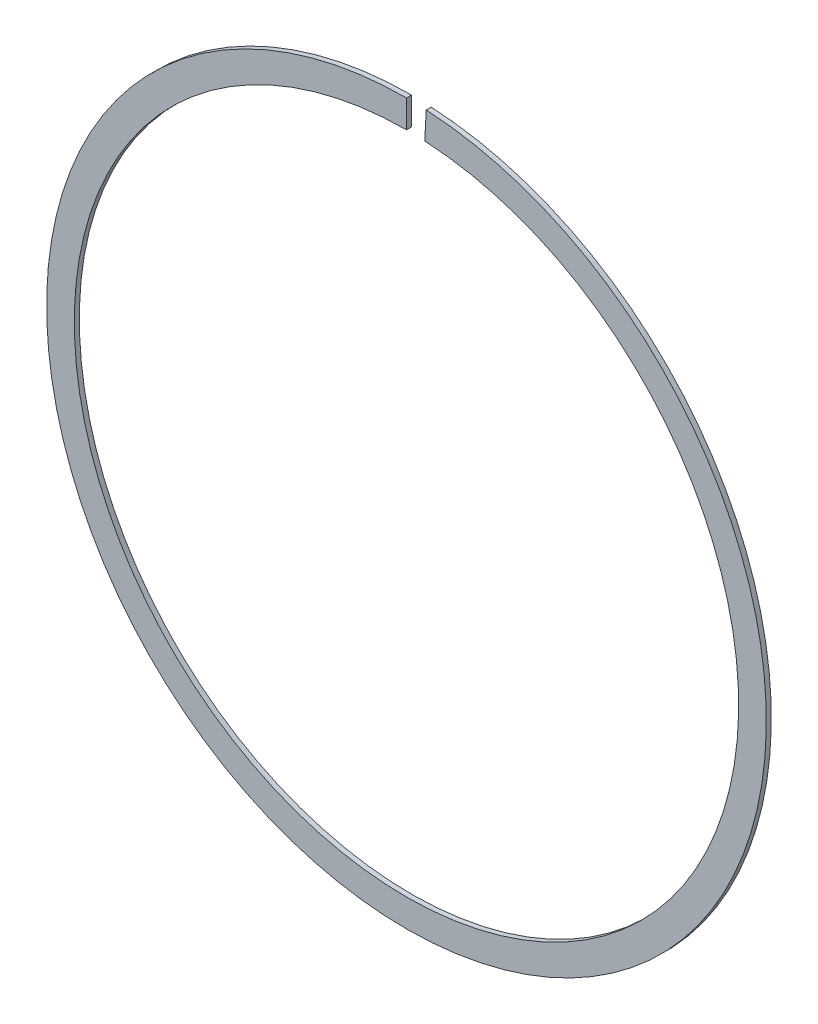
ISO-10303-21;
HEADER;
FILE_DESCRIPTION(('STEP AP214'),'2;1');
FILE_NAME('part.step','',(''),(''),'','','');
FILE_SCHEMA(('AUTOMOTIVE_DESIGN { 1 0 10303 214 1 1 1 1 }'));
ENDSEC;
DATA;
#1=APPLICATION_CONTEXT('core data for automotive mechanical design processes');
#2=APPLICATION_PROTOCOL_DEFINITION('international standard','automotive_design',2000,#1);
#3=PRODUCT_CONTEXT('',#1,'mechanical');
#4=PRODUCT('Part','Part','',(#3));
#5=PRODUCT_RELATED_PRODUCT_CATEGORY('part','',(#4));
#6=PRODUCT_DEFINITION_FORMATION('','',#4);
#7=PRODUCT_DEFINITION_CONTEXT('part definition',#1,'design');
#8=PRODUCT_DEFINITION('design','',#6,#7);
#9=PRODUCT_DEFINITION_SHAPE('','',#8);
#10=(LENGTH_UNIT() NAMED_UNIT(*) SI_UNIT(.MILLI.,.METRE.));
#11=(NAMED_UNIT(*) PLANE_ANGLE_UNIT() SI_UNIT($,.RADIAN.));
#12=(NAMED_UNIT(*) SI_UNIT($,.STERADIAN.) SOLID_ANGLE_UNIT());
#13=UNCERTAINTY_MEASURE_WITH_UNIT(LENGTH_MEASURE(1.E-05),#10,'distance_accuracy_value','');
#14=(GEOMETRIC_REPRESENTATION_CONTEXT(3) GLOBAL_UNCERTAINTY_ASSIGNED_CONTEXT((#13)) GLOBAL_UNIT_ASSIGNED_CONTEXT((#10,
#11,#12)) REPRESENTATION_CONTEXT('',''));
#15=CARTESIAN_POINT('',(0.,0.,0.));
#16=DIRECTION('',(0.,0.,1.));
#17=DIRECTION('',(1.,0.,0.));
#18=AXIS2_PLACEMENT_3D('',#15,#16,#17);
#19=CARTESIAN_POINT('',(0.,0.,0.));
#20=DIRECTION('',(1.,0.,0.));
#21=DIRECTION('',(0.,0.,-1.));
#22=AXIS2_PLACEMENT_3D('',#19,#20,#21);
#23=PLANE('',#22);
#24=DIRECTION('',(0.,-1.,0.));
#25=VECTOR('',#24,1.);
#26=CARTESIAN_POINT('',(0.,32.5,0.225));
#27=LINE('',#26,#25);
#28=CARTESIAN_POINT('',(0.,32.5,0.225));
#29=VERTEX_POINT('',#28);
#30=CARTESIAN_POINT('',(0.,30.,0.225));
#31=VERTEX_POINT('',#30);
#32=EDGE_CURVE('E89',#29,#31,#27,.T.);
#33=ORIENTED_EDGE('',*,*,#32,.T.);
#34=DIRECTION('',(0.,0.,-1.));
#35=VECTOR('',#34,1.);
#36=CARTESIAN_POINT('',(0.,30.,0.225));
#37=LINE('',#36,#35);
#38=CARTESIAN_POINT('',(0.,30.,-0.225));
#39=VERTEX_POINT('',#38);
#40=EDGE_CURVE('E82',#31,#39,#37,.T.);
#41=ORIENTED_EDGE('',*,*,#40,.T.);
#42=DIRECTION('',(0.,1.,0.));
#43=VECTOR('',#42,1.);
#44=CARTESIAN_POINT('',(0.,32.5,-0.225));
#45=LINE('',#44,#43);
#46=CARTESIAN_POINT('',(0.,32.5,-0.225));
#47=VERTEX_POINT('',#46);
#48=EDGE_CURVE('E77',#39,#47,#45,.T.);
#49=ORIENTED_EDGE('',*,*,#48,.T.);
#50=DIRECTION('',(0.,0.,1.));
#51=VECTOR('',#50,1.);
#52=CARTESIAN_POINT('',(0.,32.5,0.225));
#53=LINE('',#52,#51);
#54=EDGE_CURVE('E72',#47,#29,#53,.T.);
#55=ORIENTED_EDGE('',*,*,#54,.T.);
#56=EDGE_LOOP('',(#33,#41,#49,#55));
#57=FACE_BOUND('',#56,.T.);
#58=ADVANCED_FACE('F37',(#57),#23,.T.);
#59=CARTESIAN_POINT('',(0.,0.,0.));
#60=DIRECTION('',(0.998489097450538,-0.0549501799124381,0.));
#61=DIRECTION('',(0.,0.,-1.));
#62=AXIS2_PLACEMENT_3D('',#59,#60,#61);
#63=PLANE('',#62);
#64=DIRECTION('',(-0.0549501799124381,-0.998489097450538,0.));
#65=VECTOR('',#64,1.);
#66=CARTESIAN_POINT('',(1.78588084715424,32.4508956671425,0.225));
#67=LINE('',#66,#65);
#68=CARTESIAN_POINT('',(1.78588084715424,32.4508956671425,0.225));
#69=VERTEX_POINT('',#68);
#70=CARTESIAN_POINT('',(1.64850539737314,29.9546729235162,0.225));
#71=VERTEX_POINT('',#70);
#72=EDGE_CURVE('E98',#69,#71,#67,.T.);
#73=ORIENTED_EDGE('',*,*,#72,.F.);
#74=DIRECTION('',(0.,0.,1.));
#75=VECTOR('',#74,1.);
#76=CARTESIAN_POINT('',(1.78588084715424,32.4508956671425,0.225));
#77=LINE('',#76,#75);
#78=CARTESIAN_POINT('',(1.78588084715424,32.4508956671425,-0.225));
#79=VERTEX_POINT('',#78);
#80=EDGE_CURVE('E11',#79,#69,#77,.T.);
#81=ORIENTED_EDGE('',*,*,#80,.F.);
#82=DIRECTION('',(0.0549501799124381,0.998489097450538,0.));
#83=VECTOR('',#82,1.);
#84=CARTESIAN_POINT('',(1.78588084715424,32.4508956671425,-0.225));
#85=LINE('',#84,#83);
#86=CARTESIAN_POINT('',(1.64850539737314,29.9546729235162,-0.225));
#87=VERTEX_POINT('',#86);
#88=EDGE_CURVE('E51',#87,#79,#85,.T.);
#89=ORIENTED_EDGE('',*,*,#88,.F.);
#90=DIRECTION('',(0.,0.,-1.));
#91=VECTOR('',#90,1.);
#92=CARTESIAN_POINT('',(1.64850539737314,29.9546729235161,0.225));
#93=LINE('',#92,#91);
#94=EDGE_CURVE('E60',#71,#87,#93,.T.);
#95=ORIENTED_EDGE('',*,*,#94,.F.);
#96=EDGE_LOOP('',(#73,#81,#89,#95));
#97=FACE_BOUND('',#96,.T.);
#98=ADVANCED_FACE('F123',(#97),#63,.F.);
#99=CARTESIAN_POINT('',(0.,32.5,0.225));
#100=DIRECTION('',(0.,0.,-1.));
#101=DIRECTION('',(-1.,0.,0.));
#102=AXIS2_PLACEMENT_3D('',#99,#100,#101);
#103=PLANE('',#102);
#104=CARTESIAN_POINT('',(0.,0.,0.225));
#105=DIRECTION('',(0.,0.,1.));
#106=DIRECTION('',(0.,1.,0.));
#107=AXIS2_PLACEMENT_3D('',#104,#105,#106);
#108=CIRCLE('',#107,30.);
#109=EDGE_CURVE('E92',#31,#71,#108,.T.);
#110=ORIENTED_EDGE('',*,*,#109,.F.);
#111=ORIENTED_EDGE('',*,*,#32,.F.);
#112=CARTESIAN_POINT('',(0.,0.,0.225));
#113=DIRECTION('',(0.,0.,1.));
#114=DIRECTION('',(0.,1.,0.));
#115=AXIS2_PLACEMENT_3D('',#112,#113,#114);
#116=CIRCLE('',#115,32.5);
#117=EDGE_CURVE('E91',#29,#69,#116,.T.);
#118=ORIENTED_EDGE('',*,*,#117,.T.);
#119=ORIENTED_EDGE('',*,*,#72,.T.);
#120=EDGE_LOOP('',(#110,#111,#118,#119));
#121=FACE_BOUND('',#120,.T.);
#122=ADVANCED_FACE('F90',(#121),#103,.F.);
#123=CARTESIAN_POINT('',(0.,0.,0.));
#124=DIRECTION('',(0.,0.,1.));
#125=DIRECTION('',(1.,0.,0.));
#126=AXIS2_PLACEMENT_3D('',#123,#124,#125);
#127=CYLINDRICAL_SURFACE('',#126,30.);
#128=CARTESIAN_POINT('',(0.,0.,-0.225));
#129=DIRECTION('',(0.,0.,1.));
#130=DIRECTION('',(0.,1.,0.));
#131=AXIS2_PLACEMENT_3D('',#128,#129,#130);
#132=CIRCLE('',#131,30.);
#133=EDGE_CURVE('E106',#39,#87,#132,.T.);
#134=ORIENTED_EDGE('',*,*,#133,.F.);
#135=ORIENTED_EDGE('',*,*,#40,.F.);
#136=ORIENTED_EDGE('',*,*,#109,.T.);
#137=ORIENTED_EDGE('',*,*,#94,.T.);
#138=EDGE_LOOP('',(#134,#135,#136,#137));
#139=FACE_BOUND('',#138,.T.);
#140=ADVANCED_FACE('F114',(#139),#127,.F.);
#141=CARTESIAN_POINT('',(0.,32.5,-0.225));
#142=DIRECTION('',(0.,0.,1.));
#143=DIRECTION('',(1.,0.,0.));
#144=AXIS2_PLACEMENT_3D('',#141,#142,#143);
#145=PLANE('',#144);
#146=CARTESIAN_POINT('',(0.,0.,-0.225));
#147=DIRECTION('',(0.,0.,1.));
#148=DIRECTION('',(0.,1.,0.));
#149=AXIS2_PLACEMENT_3D('',#146,#147,#148);
#150=CIRCLE('',#149,32.5);
#151=EDGE_CURVE('E44',#47,#79,#150,.T.);
#152=ORIENTED_EDGE('',*,*,#151,.F.);
#153=ORIENTED_EDGE('',*,*,#48,.F.);
#154=ORIENTED_EDGE('',*,*,#133,.T.);
#155=ORIENTED_EDGE('',*,*,#88,.T.);
#156=EDGE_LOOP('',(#152,#153,#154,#155));
#157=FACE_BOUND('',#156,.T.);
#158=ADVANCED_FACE('F112',(#157),#145,.F.);
#159=CARTESIAN_POINT('',(0.,0.,0.));
#160=DIRECTION('',(0.,0.,1.));
#161=DIRECTION('',(1.,0.,0.));
#162=AXIS2_PLACEMENT_3D('',#159,#160,#161);
#163=CYLINDRICAL_SURFACE('',#162,32.5);
#164=ORIENTED_EDGE('',*,*,#80,.T.);
#165=ORIENTED_EDGE('',*,*,#117,.F.);
#166=ORIENTED_EDGE('',*,*,#54,.F.);
#167=ORIENTED_EDGE('',*,*,#151,.T.);
#168=EDGE_LOOP('',(#164,#165,#166,#167));
#169=FACE_BOUND('',#168,.T.);
#170=ADVANCED_FACE('F95',(#169),#163,.T.);
#171=CLOSED_SHELL('',(#58,#98,#122,#140,#158,#170));
#172=MANIFOLD_SOLID_BREP('B2',#171);
#173=ADVANCED_BREP_SHAPE_REPRESENTATION('',(#18,#172),#14);
#174=SHAPE_DEFINITION_REPRESENTATION(#9,#173);
ENDSEC;
END-ISO-10303-21;
